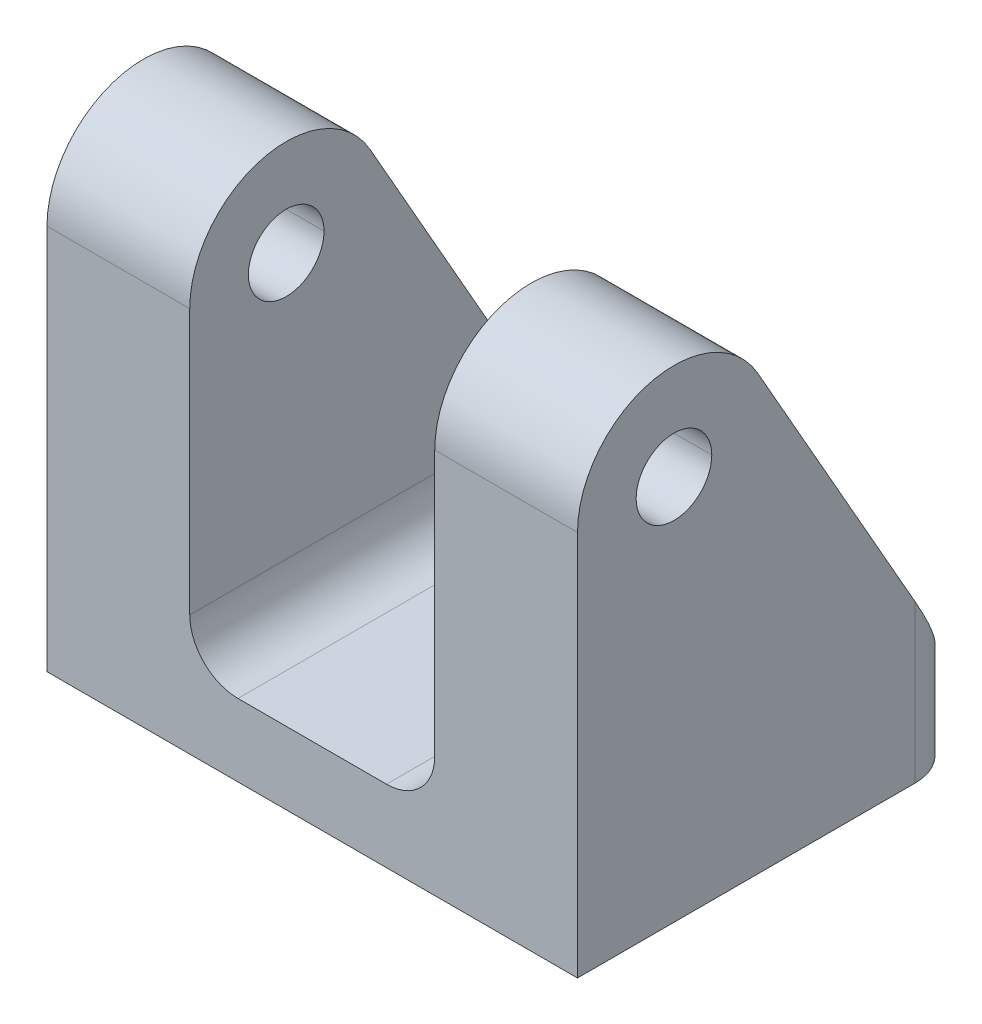
ISO-10303-21;
HEADER;
FILE_DESCRIPTION(('STEP AP214'),'2;1');
FILE_NAME('part.step','',(''),(''),'','','');
FILE_SCHEMA(('AUTOMOTIVE_DESIGN { 1 0 10303 214 1 1 1 1 }'));
ENDSEC;
DATA;
#1=APPLICATION_CONTEXT('core data for automotive mechanical design processes');
#2=APPLICATION_PROTOCOL_DEFINITION('international standard','automotive_design',2000,#1);
#3=PRODUCT_CONTEXT('',#1,'mechanical');
#4=PRODUCT('Part','Part','',(#3));
#5=PRODUCT_RELATED_PRODUCT_CATEGORY('part','',(#4));
#6=PRODUCT_DEFINITION_FORMATION('','',#4);
#7=PRODUCT_DEFINITION_CONTEXT('part definition',#1,'design');
#8=PRODUCT_DEFINITION('design','',#6,#7);
#9=PRODUCT_DEFINITION_SHAPE('','',#8);
#10=(LENGTH_UNIT() NAMED_UNIT(*) SI_UNIT(.MILLI.,.METRE.));
#11=(NAMED_UNIT(*) PLANE_ANGLE_UNIT() SI_UNIT($,.RADIAN.));
#12=(NAMED_UNIT(*) SI_UNIT($,.STERADIAN.) SOLID_ANGLE_UNIT());
#13=UNCERTAINTY_MEASURE_WITH_UNIT(LENGTH_MEASURE(1.E-05),#10,'distance_accuracy_value','');
#14=(GEOMETRIC_REPRESENTATION_CONTEXT(3) GLOBAL_UNCERTAINTY_ASSIGNED_CONTEXT((#13)) GLOBAL_UNIT_ASSIGNED_CONTEXT((#10,
#11,#12)) REPRESENTATION_CONTEXT('',''));
#15=CARTESIAN_POINT('',(0.,0.,0.));
#16=DIRECTION('',(0.,0.,1.));
#17=DIRECTION('',(1.,0.,0.));
#18=AXIS2_PLACEMENT_3D('',#15,#16,#17);
#19=CARTESIAN_POINT('',(4.8895,7.9375,-12.7));
#20=DIRECTION('',(0.,0.,-1.));
#21=DIRECTION('',(-1.,0.,0.));
#22=AXIS2_PLACEMENT_3D('',#19,#20,#21);
#23=CYLINDRICAL_SURFACE('',#22,3.175);
#24=CARTESIAN_POINT('',(4.8895,4.7625,-12.7));
#25=CARTESIAN_POINT('',(6.74937193946543,4.7625,-12.7));
#26=CARTESIAN_POINT('',(8.06450000000001,6.07762806053458,-11.9516212349029));
#27=CARTESIAN_POINT('',(8.0645,7.9375,-10.8932538355104));
#28=(BOUNDED_CURVE() B_SPLINE_CURVE(3,(#24,#25,#26,#27),.UNSPECIFIED.,.F.,
.F.) B_SPLINE_CURVE_WITH_KNOTS((4,4),(0.,1.5707963267949),
.UNSPECIFIED.) CURVE() GEOMETRIC_REPRESENTATION_ITEM() RATIONAL_B_SPLINE_CURVE((1.,
0.804737854124365,0.804737854124365,1.)) REPRESENTATION_ITEM(''));
#29=CARTESIAN_POINT('',(4.8895,4.7625,-12.7));
#30=VERTEX_POINT('',#29);
#31=CARTESIAN_POINT('',(8.0645,7.9375,-10.8932538355104));
#32=VERTEX_POINT('',#31);
#33=EDGE_CURVE('E357',#30,#32,#28,.T.);
#34=ORIENTED_EDGE('',*,*,#33,.F.);
#35=DIRECTION('',(0.,0.,-1.));
#36=VECTOR('',#35,1.);
#37=CARTESIAN_POINT('',(4.8895,4.7625,-12.7));
#38=LINE('',#37,#36);
#39=CARTESIAN_POINT('',(4.8895,4.7625,12.7));
#40=VERTEX_POINT('',#39);
#41=EDGE_CURVE('E297',#40,#30,#38,.T.);
#42=ORIENTED_EDGE('',*,*,#41,.F.);
#43=CARTESIAN_POINT('',(4.8895,7.9375,12.7));
#44=DIRECTION('',(0.,0.,-1.));
#45=DIRECTION('',(0.,-1.,0.));
#46=AXIS2_PLACEMENT_3D('',#43,#44,#45);
#47=CIRCLE('',#46,3.175);
#48=CARTESIAN_POINT('',(8.0645,7.9375,12.7));
#49=VERTEX_POINT('',#48);
#50=EDGE_CURVE('E324',#49,#40,#47,.T.);
#51=ORIENTED_EDGE('',*,*,#50,.F.);
#52=DIRECTION('',(0.,0.,1.));
#53=VECTOR('',#52,1.);
#54=CARTESIAN_POINT('',(8.0645,7.9375,12.7));
#55=LINE('',#54,#53);
#56=EDGE_CURVE('E296',#32,#49,#55,.T.);
#57=ORIENTED_EDGE('',*,*,#56,.F.);
#58=EDGE_LOOP('',(#34,#42,#51,#57));
#59=FACE_BOUND('',#58,.T.);
#60=ADVANCED_FACE('F17',(#59),#23,.F.);
#61=CARTESIAN_POINT('',(-4.8895,7.9375,-12.7));
#62=DIRECTION('',(0.,0.,-1.));
#63=DIRECTION('',(-1.,0.,0.));
#64=AXIS2_PLACEMENT_3D('',#61,#62,#63);
#65=CYLINDRICAL_SURFACE('',#64,3.175);
#66=CARTESIAN_POINT('',(-8.0645,7.9375,-10.8932538355104));
#67=CARTESIAN_POINT('',(-8.0645,6.07762806053458,-11.9516212349029));
#68=CARTESIAN_POINT('',(-6.74937193946543,4.7625,-12.7));
#69=CARTESIAN_POINT('',(-4.8895,4.7625,-12.7));
#70=(BOUNDED_CURVE() B_SPLINE_CURVE(3,(#66,#67,#68,#69),.UNSPECIFIED.,.F.,
.F.) B_SPLINE_CURVE_WITH_KNOTS((4,4),(4.71238898038469,6.28318530717959),
.UNSPECIFIED.) CURVE() GEOMETRIC_REPRESENTATION_ITEM() RATIONAL_B_SPLINE_CURVE((1.,
0.804737854124365,0.804737854124365,1.)) REPRESENTATION_ITEM(''));
#71=CARTESIAN_POINT('',(-8.0645,7.9375,-10.8932538355104));
#72=VERTEX_POINT('',#71);
#73=CARTESIAN_POINT('',(-4.8895,4.7625,-12.7));
#74=VERTEX_POINT('',#73);
#75=EDGE_CURVE('E274',#72,#74,#70,.T.);
#76=ORIENTED_EDGE('',*,*,#75,.F.);
#77=DIRECTION('',(0.,0.,-1.));
#78=VECTOR('',#77,1.);
#79=CARTESIAN_POINT('',(-8.0645,7.9375,-12.7));
#80=LINE('',#79,#78);
#81=CARTESIAN_POINT('',(-8.0645,7.9375,12.7));
#82=VERTEX_POINT('',#81);
#83=EDGE_CURVE('E293',#82,#72,#80,.T.);
#84=ORIENTED_EDGE('',*,*,#83,.F.);
#85=CARTESIAN_POINT('',(-4.8895,7.9375,12.7));
#86=DIRECTION('',(0.,0.,-1.));
#87=DIRECTION('',(0.,-1.,0.));
#88=AXIS2_PLACEMENT_3D('',#85,#86,#87);
#89=CIRCLE('',#88,3.175);
#90=CARTESIAN_POINT('',(-4.8895,4.7625,12.7));
#91=VERTEX_POINT('',#90);
#92=EDGE_CURVE('E286',#91,#82,#89,.T.);
#93=ORIENTED_EDGE('',*,*,#92,.F.);
#94=DIRECTION('',(0.,0.,1.));
#95=VECTOR('',#94,1.);
#96=CARTESIAN_POINT('',(-4.8895,4.7625,12.7));
#97=LINE('',#96,#95);
#98=EDGE_CURVE('E21',#74,#91,#97,.T.);
#99=ORIENTED_EDGE('',*,*,#98,.F.);
#100=EDGE_LOOP('',(#76,#84,#93,#99));
#101=FACE_BOUND('',#100,.T.);
#102=ADVANCED_FACE('F507',(#101),#65,.F.);
#103=CARTESIAN_POINT('',(12.7,0.,0.));
#104=DIRECTION('',(0.,-1.,0.));
#105=DIRECTION('',(0.,0.,-1.));
#106=AXIS2_PLACEMENT_3D('',#103,#104,#105);
#107=CYLINDRICAL_SURFACE('',#106,2.0193);
#108=DIRECTION('',(0.,-1.,0.));
#109=VECTOR('',#108,1.);
#110=CARTESIAN_POINT('',(12.7,0.,2.0193));
#111=LINE('',#110,#109);
#112=CARTESIAN_POINT('',(12.7,19.05,2.0193));
#113=VERTEX_POINT('',#112);
#114=CARTESIAN_POINT('',(12.7,0.,2.0193));
#115=VERTEX_POINT('',#114);
#116=EDGE_CURVE('E369',#113,#115,#111,.T.);
#117=ORIENTED_EDGE('',*,*,#116,.F.);
#118=CARTESIAN_POINT('',(12.7,19.05,0.));
#119=DIRECTION('',(0.,-1.,0.));
#120=DIRECTION('',(0.,0.,-1.));
#121=AXIS2_PLACEMENT_3D('',#118,#119,#120);
#122=CIRCLE('',#121,2.0193);
#123=CARTESIAN_POINT('',(12.7,19.05,-2.0193));
#124=VERTEX_POINT('',#123);
#125=EDGE_CURVE('E11',#124,#113,#122,.T.);
#126=ORIENTED_EDGE('',*,*,#125,.F.);
#127=DIRECTION('',(0.,-1.,0.));
#128=VECTOR('',#127,1.);
#129=CARTESIAN_POINT('',(12.7,0.,-2.0193));
#130=LINE('',#129,#128);
#131=CARTESIAN_POINT('',(12.7,0.,-2.0193));
#132=VERTEX_POINT('',#131);
#133=EDGE_CURVE('E449',#124,#132,#130,.T.);
#134=ORIENTED_EDGE('',*,*,#133,.T.);
#135=CARTESIAN_POINT('',(12.7,0.,0.));
#136=DIRECTION('',(0.,-1.,0.));
#137=DIRECTION('',(0.,0.,-1.));
#138=AXIS2_PLACEMENT_3D('',#135,#136,#137);
#139=CIRCLE('',#138,2.0193);
#140=EDGE_CURVE('E326',#132,#115,#139,.T.);
#141=ORIENTED_EDGE('',*,*,#140,.T.);
#142=EDGE_LOOP('',(#117,#126,#134,#141));
#143=FACE_BOUND('',#142,.T.);
#144=ADVANCED_FACE('F631',(#143),#107,.F.);
#145=CARTESIAN_POINT('',(12.7,19.05,0.));
#146=DIRECTION('',(0.,-1.,0.));
#147=DIRECTION('',(0.,0.,-1.));
#148=AXIS2_PLACEMENT_3D('',#145,#146,#147);
#149=CONICAL_SURFACE('',#148,2.0193,1.02974425867665);
#150=DIRECTION('',(0.,-0.515038074910057,0.857167300702111));
#151=VECTOR('',#150,1.);
#152=CARTESIAN_POINT('',(12.7,19.05,2.0193));
#153=LINE('',#152,#151);
#154=CARTESIAN_POINT('',(12.7,20.2633178480023,0.));
#155=VERTEX_POINT('',#154);
#156=EDGE_CURVE('E345',#155,#113,#153,.T.);
#157=ORIENTED_EDGE('',*,*,#156,.F.);
#158=DIRECTION('',(0.,-0.515038074910057,-0.857167300702111));
#159=VECTOR('',#158,1.);
#160=CARTESIAN_POINT('',(12.7,19.05,-2.0193));
#161=LINE('',#160,#159);
#162=EDGE_CURVE('E398',#155,#124,#161,.T.);
#163=ORIENTED_EDGE('',*,*,#162,.T.);
#164=ORIENTED_EDGE('',*,*,#125,.T.);
#165=EDGE_LOOP('',(#157,#163,#164));
#166=FACE_BOUND('',#165,.T.);
#167=ADVANCED_FACE('F19',(#166),#149,.F.);
#168=CARTESIAN_POINT('',(-12.7,0.,0.));
#169=DIRECTION('',(0.,-1.,0.));
#170=DIRECTION('',(0.,0.,-1.));
#171=AXIS2_PLACEMENT_3D('',#168,#169,#170);
#172=CYLINDRICAL_SURFACE('',#171,2.0193);
#173=DIRECTION('',(0.,-1.,0.));
#174=VECTOR('',#173,1.);
#175=CARTESIAN_POINT('',(-12.7,0.,2.0193));
#176=LINE('',#175,#174);
#177=CARTESIAN_POINT('',(-12.7,19.05,2.0193));
#178=VERTEX_POINT('',#177);
#179=CARTESIAN_POINT('',(-12.7,0.,2.0193));
#180=VERTEX_POINT('',#179);
#181=EDGE_CURVE('E344',#178,#180,#176,.T.);
#182=ORIENTED_EDGE('',*,*,#181,.F.);
#183=CARTESIAN_POINT('',(-12.7,19.05,0.));
#184=DIRECTION('',(0.,-1.,0.));
#185=DIRECTION('',(0.,0.,-1.));
#186=AXIS2_PLACEMENT_3D('',#183,#184,#185);
#187=CIRCLE('',#186,2.0193);
#188=CARTESIAN_POINT('',(-12.7,19.05,-2.0193));
#189=VERTEX_POINT('',#188);
#190=EDGE_CURVE('E28',#189,#178,#187,.T.);
#191=ORIENTED_EDGE('',*,*,#190,.F.);
#192=DIRECTION('',(0.,-1.,0.));
#193=VECTOR('',#192,1.);
#194=CARTESIAN_POINT('',(-12.7,0.,-2.0193));
#195=LINE('',#194,#193);
#196=CARTESIAN_POINT('',(-12.7,0.,-2.0193));
#197=VERTEX_POINT('',#196);
#198=EDGE_CURVE('E243',#189,#197,#195,.T.);
#199=ORIENTED_EDGE('',*,*,#198,.T.);
#200=CARTESIAN_POINT('',(-12.7,0.,0.));
#201=DIRECTION('',(0.,-1.,0.));
#202=DIRECTION('',(0.,0.,-1.));
#203=AXIS2_PLACEMENT_3D('',#200,#201,#202);
#204=CIRCLE('',#203,2.0193);
#205=EDGE_CURVE('E329',#197,#180,#204,.T.);
#206=ORIENTED_EDGE('',*,*,#205,.T.);
#207=EDGE_LOOP('',(#182,#191,#199,#206));
#208=FACE_BOUND('',#207,.T.);
#209=ADVANCED_FACE('F644',(#208),#172,.F.);
#210=CARTESIAN_POINT('',(-12.7,19.05,0.));
#211=DIRECTION('',(0.,-1.,0.));
#212=DIRECTION('',(0.,0.,-1.));
#213=AXIS2_PLACEMENT_3D('',#210,#211,#212);
#214=CONICAL_SURFACE('',#213,2.0193,1.02974425867665);
#215=DIRECTION('',(0.,-0.515038074910057,0.857167300702111));
#216=VECTOR('',#215,1.);
#217=CARTESIAN_POINT('',(-12.7,19.05,2.0193));
#218=LINE('',#217,#216);
#219=CARTESIAN_POINT('',(-12.7,20.2633178480023,0.));
#220=VERTEX_POINT('',#219);
#221=EDGE_CURVE('E228',#220,#178,#218,.T.);
#222=ORIENTED_EDGE('',*,*,#221,.F.);
#223=DIRECTION('',(0.,-0.515038074910057,-0.857167300702111));
#224=VECTOR('',#223,1.);
#225=CARTESIAN_POINT('',(-12.7,19.05,-2.0193));
#226=LINE('',#225,#224);
#227=EDGE_CURVE('E231',#220,#189,#226,.T.);
#228=ORIENTED_EDGE('',*,*,#227,.T.);
#229=ORIENTED_EDGE('',*,*,#190,.T.);
#230=EDGE_LOOP('',(#222,#228,#229));
#231=FACE_BOUND('',#230,.T.);
#232=ADVANCED_FACE('F230',(#231),#214,.F.);
#233=CARTESIAN_POINT('',(0.,0.,0.));
#234=DIRECTION('',(0.,-1.,0.));
#235=DIRECTION('',(0.,0.,-1.));
#236=AXIS2_PLACEMENT_3D('',#233,#234,#235);
#237=CYLINDRICAL_SURFACE('',#236,2.0193);
#238=DIRECTION('',(0.,-1.,0.));
#239=VECTOR('',#238,1.);
#240=CARTESIAN_POINT('',(0.,0.,2.0193));
#241=LINE('',#240,#239);
#242=CARTESIAN_POINT('',(0.,4.7625,2.0193));
#243=VERTEX_POINT('',#242);
#244=CARTESIAN_POINT('',(0.,0.,2.0193));
#245=VERTEX_POINT('',#244);
#246=EDGE_CURVE('E394',#243,#245,#241,.T.);
#247=ORIENTED_EDGE('',*,*,#246,.F.);
#248=CARTESIAN_POINT('',(0.,4.7625,0.));
#249=DIRECTION('',(0.,-1.,0.));
#250=DIRECTION('',(1.,0.,0.));
#251=AXIS2_PLACEMENT_3D('',#248,#249,#250);
#252=CIRCLE('',#251,2.0193);
#253=CARTESIAN_POINT('',(0.,4.7625,-2.0193));
#254=VERTEX_POINT('',#253);
#255=EDGE_CURVE('E300',#254,#243,#252,.T.);
#256=ORIENTED_EDGE('',*,*,#255,.F.);
#257=DIRECTION('',(0.,-1.,0.));
#258=VECTOR('',#257,1.);
#259=CARTESIAN_POINT('',(0.,0.,-2.0193));
#260=LINE('',#259,#258);
#261=CARTESIAN_POINT('',(0.,0.,-2.0193));
#262=VERTEX_POINT('',#261);
#263=EDGE_CURVE('E292',#254,#262,#260,.T.);
#264=ORIENTED_EDGE('',*,*,#263,.T.);
#265=CARTESIAN_POINT('',(0.,0.,0.));
#266=DIRECTION('',(0.,-1.,0.));
#267=DIRECTION('',(0.,0.,-1.));
#268=AXIS2_PLACEMENT_3D('',#265,#266,#267);
#269=CIRCLE('',#268,2.0193);
#270=EDGE_CURVE('E333',#262,#245,#269,.T.);
#271=ORIENTED_EDGE('',*,*,#270,.T.);
#272=EDGE_LOOP('',(#247,#256,#264,#271));
#273=FACE_BOUND('',#272,.T.);
#274=ADVANCED_FACE('F464',(#273),#237,.F.);
#275=CARTESIAN_POINT('',(-14.2875,0.,-9.525));
#276=DIRECTION('',(0.,1.,0.));
#277=DIRECTION('',(0.,0.,1.));
#278=AXIS2_PLACEMENT_3D('',#275,#276,#277);
#279=CYLINDRICAL_SURFACE('',#278,3.175);
#280=CARTESIAN_POINT('',(-14.2875,4.7625,-12.7));
#281=CARTESIAN_POINT('',(-16.1473719394654,4.76250000000002,-12.7));
#282=CARTESIAN_POINT('',(-17.4625,7.07357815489786,-11.3848719394654));
#283=CARTESIAN_POINT('',(-17.4625,10.3419362252586,-9.525));
#284=(BOUNDED_CURVE() B_SPLINE_CURVE(3,(#280,#281,#282,#283),.UNSPECIFIED.,.F.,
.F.) B_SPLINE_CURVE_WITH_KNOTS((4,4),(3.1415926535898,4.71238898038469),
.UNSPECIFIED.) CURVE() GEOMETRIC_REPRESENTATION_ITEM() RATIONAL_B_SPLINE_CURVE((1.,
0.804737854124365,0.804737854124365,1.)) REPRESENTATION_ITEM(''));
#285=CARTESIAN_POINT('',(-14.2875,4.7625,-12.7));
#286=VERTEX_POINT('',#285);
#287=CARTESIAN_POINT('',(-17.4625,10.3419362252586,-9.525));
#288=VERTEX_POINT('',#287);
#289=EDGE_CURVE('E255',#286,#288,#284,.T.);
#290=ORIENTED_EDGE('',*,*,#289,.F.);
#291=DIRECTION('',(0.,1.,0.));
#292=VECTOR('',#291,1.);
#293=CARTESIAN_POINT('',(-14.2875,4.7625,-12.7));
#294=LINE('',#293,#292);
#295=CARTESIAN_POINT('',(-14.2875,0.,-12.7));
#296=VERTEX_POINT('',#295);
#297=EDGE_CURVE('E305',#296,#286,#294,.T.);
#298=ORIENTED_EDGE('',*,*,#297,.F.);
#299=CARTESIAN_POINT('',(-14.2875,0.,-9.525));
#300=DIRECTION('',(0.,-1.,0.));
#301=DIRECTION('',(0.,0.,-1.));
#302=AXIS2_PLACEMENT_3D('',#299,#300,#301);
#303=CIRCLE('',#302,3.175);
#304=CARTESIAN_POINT('',(-17.4625,0.,-9.525));
#305=VERTEX_POINT('',#304);
#306=EDGE_CURVE('E330',#305,#296,#303,.T.);
#307=ORIENTED_EDGE('',*,*,#306,.F.);
#308=DIRECTION('',(0.,-1.,0.));
#309=VECTOR('',#308,1.);
#310=CARTESIAN_POINT('',(-17.4625,0.,-9.525));
#311=LINE('',#310,#309);
#312=EDGE_CURVE('E42',#288,#305,#311,.T.);
#313=ORIENTED_EDGE('',*,*,#312,.F.);
#314=EDGE_LOOP('',(#290,#298,#307,#313));
#315=FACE_BOUND('',#314,.T.);
#316=ADVANCED_FACE('F494',(#315),#279,.T.);
#317=CARTESIAN_POINT('',(14.2875,0.,-9.525));
#318=DIRECTION('',(0.,-1.,0.));
#319=DIRECTION('',(0.,0.,-1.));
#320=AXIS2_PLACEMENT_3D('',#317,#318,#319);
#321=CYLINDRICAL_SURFACE('',#320,3.175);
#322=CARTESIAN_POINT('',(17.4625,10.3419362252586,-9.525));
#323=CARTESIAN_POINT('',(17.4625,7.07357815489786,-11.3848719394654));
#324=CARTESIAN_POINT('',(16.1473719394654,4.76250000000001,-12.7));
#325=CARTESIAN_POINT('',(14.2875,4.7625,-12.7));
#326=(BOUNDED_CURVE() B_SPLINE_CURVE(3,(#322,#323,#324,#325),.UNSPECIFIED.,.F.,
.F.) B_SPLINE_CURVE_WITH_KNOTS((4,4),(4.71238898038469,6.28318530717959),
.UNSPECIFIED.) CURVE() GEOMETRIC_REPRESENTATION_ITEM() RATIONAL_B_SPLINE_CURVE((1.,
0.804737854124365,0.804737854124365,1.)) REPRESENTATION_ITEM(''));
#327=CARTESIAN_POINT('',(17.4625,10.3419362252586,-9.525));
#328=VERTEX_POINT('',#327);
#329=CARTESIAN_POINT('',(14.2875,4.7625,-12.7));
#330=VERTEX_POINT('',#329);
#331=EDGE_CURVE('E337',#328,#330,#326,.T.);
#332=ORIENTED_EDGE('',*,*,#331,.F.);
#333=DIRECTION('',(0.,1.,0.));
#334=VECTOR('',#333,1.);
#335=CARTESIAN_POINT('',(17.4625,0.,-9.525));
#336=LINE('',#335,#334);
#337=CARTESIAN_POINT('',(17.4625,0.,-9.525));
#338=VERTEX_POINT('',#337);
#339=EDGE_CURVE('E408',#338,#328,#336,.T.);
#340=ORIENTED_EDGE('',*,*,#339,.F.);
#341=CARTESIAN_POINT('',(14.2875,0.,-9.525));
#342=DIRECTION('',(0.,-1.,0.));
#343=DIRECTION('',(0.,0.,-1.));
#344=AXIS2_PLACEMENT_3D('',#341,#342,#343);
#345=CIRCLE('',#344,3.175);
#346=CARTESIAN_POINT('',(14.2875,0.,-12.7));
#347=VERTEX_POINT('',#346);
#348=EDGE_CURVE('E285',#347,#338,#345,.T.);
#349=ORIENTED_EDGE('',*,*,#348,.F.);
#350=DIRECTION('',(0.,-1.,0.));
#351=VECTOR('',#350,1.);
#352=CARTESIAN_POINT('',(14.2875,0.,-12.7));
#353=LINE('',#352,#351);
#354=EDGE_CURVE('E309',#330,#347,#353,.T.);
#355=ORIENTED_EDGE('',*,*,#354,.F.);
#356=EDGE_LOOP('',(#332,#340,#349,#355));
#357=FACE_BOUND('',#356,.T.);
#358=ADVANCED_FACE('F470',(#357),#321,.T.);
#359=CARTESIAN_POINT('',(-8.0645,4.7625,-12.7));
#360=DIRECTION('',(0.,-1.,0.));
#361=DIRECTION('',(0.,0.,-1.));
#362=AXIS2_PLACEMENT_3D('',#359,#360,#361);
#363=PLANE('',#362);
#364=ORIENTED_EDGE('',*,*,#255,.T.);
#365=CARTESIAN_POINT('',(0.,4.7625,0.));
#366=DIRECTION('',(0.,-1.,0.));
#367=DIRECTION('',(1.,0.,0.));
#368=AXIS2_PLACEMENT_3D('',#365,#366,#367);
#369=CIRCLE('',#368,2.0193);
#370=EDGE_CURVE('E237',#243,#254,#369,.T.);
#371=ORIENTED_EDGE('',*,*,#370,.T.);
#372=EDGE_LOOP('',(#364,#371));
#373=FACE_BOUND('',#372,.T.);
#374=DIRECTION('',(1.,0.,0.));
#375=VECTOR('',#374,1.);
#376=CARTESIAN_POINT('',(-8.0645,4.7625,-12.7));
#377=LINE('',#376,#375);
#378=EDGE_CURVE('E308',#74,#30,#377,.T.);
#379=ORIENTED_EDGE('',*,*,#378,.F.);
#380=ORIENTED_EDGE('',*,*,#98,.T.);
#381=DIRECTION('',(1.,0.,0.));
#382=VECTOR('',#381,1.);
#383=CARTESIAN_POINT('',(-8.0645,4.7625,12.7));
#384=LINE('',#383,#382);
#385=EDGE_CURVE('E361',#91,#40,#384,.T.);
#386=ORIENTED_EDGE('',*,*,#385,.T.);
#387=ORIENTED_EDGE('',*,*,#41,.T.);
#388=EDGE_LOOP('',(#379,#380,#386,#387));
#389=FACE_BOUND('',#388,.T.);
#390=ADVANCED_FACE('F466',(#373,#389),#363,.F.);
#391=CARTESIAN_POINT('',(8.0645,4.7625,-12.7));
#392=DIRECTION('',(1.,0.,0.));
#393=DIRECTION('',(0.,1.,0.));
#394=AXIS2_PLACEMENT_3D('',#391,#392,#393);
#395=PLANE('',#394);
#396=CARTESIAN_POINT('',(8.0645,25.4,6.35));
#397=DIRECTION('',(1.,0.,0.));
#398=DIRECTION('',(0.,1.,0.));
#399=AXIS2_PLACEMENT_3D('',#396,#397,#398);
#400=CIRCLE('',#399,2.4892);
#401=CARTESIAN_POINT('',(8.0645,25.4,8.8392));
#402=VERTEX_POINT('',#401);
#403=CARTESIAN_POINT('',(8.0645,25.4,3.8608));
#404=VERTEX_POINT('',#403);
#405=EDGE_CURVE('E304',#402,#404,#400,.T.);
#406=ORIENTED_EDGE('',*,*,#405,.T.);
#407=CARTESIAN_POINT('',(8.0645,25.4,6.35));
#408=DIRECTION('',(1.,0.,0.));
#409=DIRECTION('',(0.,1.,0.));
#410=AXIS2_PLACEMENT_3D('',#407,#408,#409);
#411=CIRCLE('',#410,2.4892);
#412=EDGE_CURVE('E411',#404,#402,#411,.T.);
#413=ORIENTED_EDGE('',*,*,#412,.T.);
#414=EDGE_LOOP('',(#406,#413));
#415=FACE_BOUND('',#414,.T.);
#416=DIRECTION('',(0.,0.869130808993556,0.494582285224821));
#417=VECTOR('',#416,1.);
#418=CARTESIAN_POINT('',(8.0645,6.62414303176311,-11.6406247536105));
#419=LINE('',#418,#417);
#420=CARTESIAN_POINT('',(8.0645,28.5405975111776,0.831019362890917));
#421=VERTEX_POINT('',#420);
#422=EDGE_CURVE('E352',#32,#421,#419,.T.);
#423=ORIENTED_EDGE('',*,*,#422,.F.);
#424=ORIENTED_EDGE('',*,*,#56,.T.);
#425=DIRECTION('',(0.,1.,0.));
#426=VECTOR('',#425,1.);
#427=CARTESIAN_POINT('',(8.0645,4.7625,12.7));
#428=LINE('',#427,#426);
#429=CARTESIAN_POINT('',(8.0645,25.4,12.7));
#430=VERTEX_POINT('',#429);
#431=EDGE_CURVE('E321',#49,#430,#428,.T.);
#432=ORIENTED_EDGE('',*,*,#431,.T.);
#433=CARTESIAN_POINT('',(8.0645,25.4,6.35));
#434=DIRECTION('',(1.,0.,0.));
#435=DIRECTION('',(0.,1.,0.));
#436=AXIS2_PLACEMENT_3D('',#433,#434,#435);
#437=CIRCLE('',#436,6.35);
#438=EDGE_CURVE('E280',#421,#430,#437,.T.);
#439=ORIENTED_EDGE('',*,*,#438,.F.);
#440=EDGE_LOOP('',(#423,#424,#432,#439));
#441=FACE_BOUND('',#440,.T.);
#442=ADVANCED_FACE('F469',(#415,#441),#395,.F.);
#443=CARTESIAN_POINT('',(-8.0645,4.7625,-12.7));
#444=DIRECTION('',(-1.,0.,0.));
#445=DIRECTION('',(0.,0.,1.));
#446=AXIS2_PLACEMENT_3D('',#443,#444,#445);
#447=PLANE('',#446);
#448=CARTESIAN_POINT('',(-8.0645,25.4,6.35));
#449=DIRECTION('',(-1.,0.,0.));
#450=DIRECTION('',(0.,0.,1.));
#451=AXIS2_PLACEMENT_3D('',#448,#449,#450);
#452=CIRCLE('',#451,2.4892);
#453=CARTESIAN_POINT('',(-8.0645,25.4,8.8392));
#454=VERTEX_POINT('',#453);
#455=CARTESIAN_POINT('',(-8.0645,25.4,3.8608));
#456=VERTEX_POINT('',#455);
#457=EDGE_CURVE('E320',#454,#456,#452,.T.);
#458=ORIENTED_EDGE('',*,*,#457,.T.);
#459=CARTESIAN_POINT('',(-8.0645,25.4,6.35));
#460=DIRECTION('',(-1.,0.,0.));
#461=DIRECTION('',(0.,0.,1.));
#462=AXIS2_PLACEMENT_3D('',#459,#460,#461);
#463=CIRCLE('',#462,2.4892);
#464=EDGE_CURVE('E315',#456,#454,#463,.T.);
#465=ORIENTED_EDGE('',*,*,#464,.T.);
#466=EDGE_LOOP('',(#458,#465));
#467=FACE_BOUND('',#466,.T.);
#468=DIRECTION('',(0.,-1.,0.));
#469=VECTOR('',#468,1.);
#470=CARTESIAN_POINT('',(-8.0645,4.7625,12.7));
#471=LINE('',#470,#469);
#472=CARTESIAN_POINT('',(-8.0645,25.4,12.7));
#473=VERTEX_POINT('',#472);
#474=EDGE_CURVE('E420',#473,#82,#471,.T.);
#475=ORIENTED_EDGE('',*,*,#474,.T.);
#476=ORIENTED_EDGE('',*,*,#83,.T.);
#477=DIRECTION('',(0.,-0.869130808993556,-0.494582285224821));
#478=VECTOR('',#477,1.);
#479=CARTESIAN_POINT('',(-8.0645,6.62414303176311,-11.6406247536105));
#480=LINE('',#479,#478);
#481=CARTESIAN_POINT('',(-8.0645,28.5405975111776,0.831019362890917));
#482=VERTEX_POINT('',#481);
#483=EDGE_CURVE('E341',#482,#72,#480,.T.);
#484=ORIENTED_EDGE('',*,*,#483,.F.);
#485=CARTESIAN_POINT('',(-8.0645,25.4,6.35));
#486=DIRECTION('',(-1.,0.,0.));
#487=DIRECTION('',(0.,0.,1.));
#488=AXIS2_PLACEMENT_3D('',#485,#486,#487);
#489=CIRCLE('',#488,6.35);
#490=EDGE_CURVE('E273',#473,#482,#489,.T.);
#491=ORIENTED_EDGE('',*,*,#490,.F.);
#492=EDGE_LOOP('',(#475,#476,#484,#491));
#493=FACE_BOUND('',#492,.T.);
#494=ADVANCED_FACE('F505',(#467,#493),#447,.F.);
#495=CARTESIAN_POINT('',(-17.4625,0.,0.));
#496=DIRECTION('',(1.,0.,0.));
#497=DIRECTION('',(0.,1.,0.));
#498=AXIS2_PLACEMENT_3D('',#495,#496,#497);
#499=PLANE('',#498);
#500=CARTESIAN_POINT('',(-17.4625,25.4,6.35));
#501=DIRECTION('',(1.,0.,0.));
#502=DIRECTION('',(0.,0.,-1.));
#503=AXIS2_PLACEMENT_3D('',#500,#501,#502);
#504=CIRCLE('',#503,2.4892);
#505=CARTESIAN_POINT('',(-17.4625,25.4,8.8392));
#506=VERTEX_POINT('',#505);
#507=CARTESIAN_POINT('',(-17.4625,25.4,3.8608));
#508=VERTEX_POINT('',#507);
#509=EDGE_CURVE('E314',#506,#508,#504,.T.);
#510=ORIENTED_EDGE('',*,*,#509,.T.);
#511=CARTESIAN_POINT('',(-17.4625,25.4,6.35));
#512=DIRECTION('',(1.,0.,0.));
#513=DIRECTION('',(0.,0.,-1.));
#514=AXIS2_PLACEMENT_3D('',#511,#512,#513);
#515=CIRCLE('',#514,2.4892);
#516=EDGE_CURVE('E316',#508,#506,#515,.T.);
#517=ORIENTED_EDGE('',*,*,#516,.T.);
#518=EDGE_LOOP('',(#510,#517));
#519=FACE_BOUND('',#518,.T.);
#520=DIRECTION('',(0.,0.869130808993556,0.494582285224821));
#521=VECTOR('',#520,1.);
#522=CARTESIAN_POINT('',(-17.4625,6.62414303176311,-11.6406247536105));
#523=LINE('',#522,#521);
#524=CARTESIAN_POINT('',(-17.4625,28.5405975111776,0.831019362890918));
#525=VERTEX_POINT('',#524);
#526=EDGE_CURVE('E260',#288,#525,#523,.T.);
#527=ORIENTED_EDGE('',*,*,#526,.F.);
#528=ORIENTED_EDGE('',*,*,#312,.T.);
#529=DIRECTION('',(0.,0.,1.));
#530=VECTOR('',#529,1.);
#531=CARTESIAN_POINT('',(-17.4625,0.,0.));
#532=LINE('',#531,#530);
#533=CARTESIAN_POINT('',(-17.4625,0.,12.7));
#534=VERTEX_POINT('',#533);
#535=EDGE_CURVE('E402',#305,#534,#532,.T.);
#536=ORIENTED_EDGE('',*,*,#535,.T.);
#537=DIRECTION('',(0.,1.,0.));
#538=VECTOR('',#537,1.);
#539=CARTESIAN_POINT('',(-17.4625,0.,12.7));
#540=LINE('',#539,#538);
#541=CARTESIAN_POINT('',(-17.4625,25.4,12.7));
#542=VERTEX_POINT('',#541);
#543=EDGE_CURVE('E423',#534,#542,#540,.T.);
#544=ORIENTED_EDGE('',*,*,#543,.T.);
#545=CARTESIAN_POINT('',(-17.4625,25.4,6.35));
#546=DIRECTION('',(1.,0.,0.));
#547=DIRECTION('',(0.,0.,-1.));
#548=AXIS2_PLACEMENT_3D('',#545,#546,#547);
#549=CIRCLE('',#548,6.35);
#550=EDGE_CURVE('E427',#525,#542,#549,.T.);
#551=ORIENTED_EDGE('',*,*,#550,.F.);
#552=EDGE_LOOP('',(#527,#528,#536,#544,#551));
#553=FACE_BOUND('',#552,.T.);
#554=ADVANCED_FACE('F495',(#519,#553),#499,.F.);
#555=CARTESIAN_POINT('',(17.4625,0.,0.));
#556=DIRECTION('',(1.,0.,0.));
#557=DIRECTION('',(0.,1.,0.));
#558=AXIS2_PLACEMENT_3D('',#555,#556,#557);
#559=PLANE('',#558);
#560=CARTESIAN_POINT('',(17.4625,25.4,6.35));
#561=DIRECTION('',(1.,0.,0.));
#562=DIRECTION('',(0.,0.,-1.));
#563=AXIS2_PLACEMENT_3D('',#560,#561,#562);
#564=CIRCLE('',#563,2.4892);
#565=CARTESIAN_POINT('',(17.4625,25.4,8.8392));
#566=VERTEX_POINT('',#565);
#567=CARTESIAN_POINT('',(17.4625,25.4,3.8608));
#568=VERTEX_POINT('',#567);
#569=EDGE_CURVE('E287',#566,#568,#564,.T.);
#570=ORIENTED_EDGE('',*,*,#569,.F.);
#571=CARTESIAN_POINT('',(17.4625,25.4,6.35));
#572=DIRECTION('',(1.,0.,0.));
#573=DIRECTION('',(0.,0.,-1.));
#574=AXIS2_PLACEMENT_3D('',#571,#572,#573);
#575=CIRCLE('',#574,2.4892);
#576=EDGE_CURVE('E481',#568,#566,#575,.T.);
#577=ORIENTED_EDGE('',*,*,#576,.F.);
#578=EDGE_LOOP('',(#570,#577));
#579=FACE_BOUND('',#578,.T.);
#580=DIRECTION('',(0.,0.,1.));
#581=VECTOR('',#580,1.);
#582=CARTESIAN_POINT('',(17.4625,0.,0.));
#583=LINE('',#582,#581);
#584=CARTESIAN_POINT('',(17.4625,0.,12.7));
#585=VERTEX_POINT('',#584);
#586=EDGE_CURVE('E405',#338,#585,#583,.T.);
#587=ORIENTED_EDGE('',*,*,#586,.F.);
#588=ORIENTED_EDGE('',*,*,#339,.T.);
#589=DIRECTION('',(0.,0.869130808993556,0.494582285224821));
#590=VECTOR('',#589,1.);
#591=CARTESIAN_POINT('',(17.4625,6.62414303176311,-11.6406247536105));
#592=LINE('',#591,#590);
#593=CARTESIAN_POINT('',(17.4625,28.5405975111776,0.831019362890918));
#594=VERTEX_POINT('',#593);
#595=EDGE_CURVE('E319',#328,#594,#592,.T.);
#596=ORIENTED_EDGE('',*,*,#595,.T.);
#597=CARTESIAN_POINT('',(17.4625,25.4,6.35));
#598=DIRECTION('',(1.,0.,0.));
#599=DIRECTION('',(0.,0.,-1.));
#600=AXIS2_PLACEMENT_3D('',#597,#598,#599);
#601=CIRCLE('',#600,6.35);
#602=CARTESIAN_POINT('',(17.4625,25.4,12.7));
#603=VERTEX_POINT('',#602);
#604=EDGE_CURVE('E279',#594,#603,#601,.T.);
#605=ORIENTED_EDGE('',*,*,#604,.T.);
#606=DIRECTION('',(0.,1.,0.));
#607=VECTOR('',#606,1.);
#608=CARTESIAN_POINT('',(17.4625,0.,12.7));
#609=LINE('',#608,#607);
#610=EDGE_CURVE('E325',#585,#603,#609,.T.);
#611=ORIENTED_EDGE('',*,*,#610,.F.);
#612=EDGE_LOOP('',(#587,#588,#596,#605,#611));
#613=FACE_BOUND('',#612,.T.);
#614=ADVANCED_FACE('F592',(#579,#613),#559,.T.);
#615=CARTESIAN_POINT('',(17.4625,25.4,6.35));
#616=DIRECTION('',(-1.,0.,0.));
#617=DIRECTION('',(0.,0.,1.));
#618=AXIS2_PLACEMENT_3D('',#615,#616,#617);
#619=CYLINDRICAL_SURFACE('',#618,2.4892);
#620=DIRECTION('',(-1.,0.,0.));
#621=VECTOR('',#620,1.);
#622=CARTESIAN_POINT('',(17.4625,25.4,3.8608));
#623=LINE('',#622,#621);
#624=EDGE_CURVE('E291',#568,#404,#623,.T.);
#625=ORIENTED_EDGE('',*,*,#624,.F.);
#626=ORIENTED_EDGE('',*,*,#576,.T.);
#627=DIRECTION('',(-1.,0.,0.));
#628=VECTOR('',#627,1.);
#629=CARTESIAN_POINT('',(17.4625,25.4,8.8392));
#630=LINE('',#629,#628);
#631=EDGE_CURVE('E419',#566,#402,#630,.T.);
#632=ORIENTED_EDGE('',*,*,#631,.T.);
#633=ORIENTED_EDGE('',*,*,#412,.F.);
#634=EDGE_LOOP('',(#625,#626,#632,#633));
#635=FACE_BOUND('',#634,.T.);
#636=ADVANCED_FACE('F611',(#635),#619,.F.);
#637=CARTESIAN_POINT('',(17.4625,0.,-12.7));
#638=DIRECTION('',(0.,0.,-1.));
#639=DIRECTION('',(0.,-1.,0.));
#640=AXIS2_PLACEMENT_3D('',#637,#638,#639);
#641=PLANE('',#640);
#642=DIRECTION('',(-1.,0.,0.));
#643=VECTOR('',#642,1.);
#644=CARTESIAN_POINT('',(17.4625,4.7625,-12.7));
#645=LINE('',#644,#643);
#646=EDGE_CURVE('E525',#330,#30,#645,.T.);
#647=ORIENTED_EDGE('',*,*,#646,.F.);
#648=ORIENTED_EDGE('',*,*,#354,.T.);
#649=DIRECTION('',(-1.,0.,0.));
#650=VECTOR('',#649,1.);
#651=CARTESIAN_POINT('',(17.4625,0.,-12.7));
#652=LINE('',#651,#650);
#653=EDGE_CURVE('E281',#347,#296,#652,.T.);
#654=ORIENTED_EDGE('',*,*,#653,.T.);
#655=ORIENTED_EDGE('',*,*,#297,.T.);
#656=DIRECTION('',(-1.,0.,0.));
#657=VECTOR('',#656,1.);
#658=CARTESIAN_POINT('',(17.4625,4.7625,-12.7));
#659=LINE('',#658,#657);
#660=EDGE_CURVE('E261',#74,#286,#659,.T.);
#661=ORIENTED_EDGE('',*,*,#660,.F.);
#662=ORIENTED_EDGE('',*,*,#378,.T.);
#663=EDGE_LOOP('',(#647,#648,#654,#655,#661,#662));
#664=FACE_BOUND('',#663,.T.);
#665=ADVANCED_FACE('F489',(#664),#641,.T.);
#666=CARTESIAN_POINT('',(17.4625,0.,0.));
#667=DIRECTION('',(0.,-1.,0.));
#668=DIRECTION('',(0.,0.,-1.));
#669=AXIS2_PLACEMENT_3D('',#666,#667,#668);
#670=PLANE('',#669);
#671=ORIENTED_EDGE('',*,*,#270,.F.);
#672=CARTESIAN_POINT('',(0.,0.,0.));
#673=DIRECTION('',(0.,-1.,0.));
#674=DIRECTION('',(0.,0.,-1.));
#675=AXIS2_PLACEMENT_3D('',#672,#673,#674);
#676=CIRCLE('',#675,2.0193);
#677=EDGE_CURVE('E351',#245,#262,#676,.T.);
#678=ORIENTED_EDGE('',*,*,#677,.F.);
#679=EDGE_LOOP('',(#671,#678));
#680=FACE_BOUND('',#679,.T.);
#681=ORIENTED_EDGE('',*,*,#205,.F.);
#682=CARTESIAN_POINT('',(-12.7,0.,0.));
#683=DIRECTION('',(0.,-1.,0.));
#684=DIRECTION('',(0.,0.,-1.));
#685=AXIS2_PLACEMENT_3D('',#682,#683,#684);
#686=CIRCLE('',#685,2.0193);
#687=EDGE_CURVE('E251',#180,#197,#686,.T.);
#688=ORIENTED_EDGE('',*,*,#687,.F.);
#689=EDGE_LOOP('',(#681,#688));
#690=FACE_BOUND('',#689,.T.);
#691=ORIENTED_EDGE('',*,*,#140,.F.);
#692=CARTESIAN_POINT('',(12.7,0.,0.));
#693=DIRECTION('',(0.,-1.,0.));
#694=DIRECTION('',(0.,0.,-1.));
#695=AXIS2_PLACEMENT_3D('',#692,#693,#694);
#696=CIRCLE('',#695,2.0193);
#697=EDGE_CURVE('E453',#115,#132,#696,.T.);
#698=ORIENTED_EDGE('',*,*,#697,.F.);
#699=EDGE_LOOP('',(#691,#698));
#700=FACE_BOUND('',#699,.T.);
#701=ORIENTED_EDGE('',*,*,#653,.F.);
#702=ORIENTED_EDGE('',*,*,#348,.T.);
#703=ORIENTED_EDGE('',*,*,#586,.T.);
#704=DIRECTION('',(-1.,0.,0.));
#705=VECTOR('',#704,1.);
#706=CARTESIAN_POINT('',(17.4625,0.,12.7));
#707=LINE('',#706,#705);
#708=EDGE_CURVE('E401',#585,#534,#707,.T.);
#709=ORIENTED_EDGE('',*,*,#708,.T.);
#710=ORIENTED_EDGE('',*,*,#535,.F.);
#711=ORIENTED_EDGE('',*,*,#306,.T.);
#712=EDGE_LOOP('',(#701,#702,#703,#709,#710,#711));
#713=FACE_BOUND('',#712,.T.);
#714=ADVANCED_FACE('F597',(#680,#690,#700,#713),#670,.T.);
#715=CARTESIAN_POINT('',(17.4625,0.,12.7));
#716=DIRECTION('',(0.,0.,1.));
#717=DIRECTION('',(0.,-1.,0.));
#718=AXIS2_PLACEMENT_3D('',#715,#716,#717);
#719=PLANE('',#718);
#720=ORIENTED_EDGE('',*,*,#474,.F.);
#721=DIRECTION('',(-1.,0.,0.));
#722=VECTOR('',#721,1.);
#723=CARTESIAN_POINT('',(17.4625,25.4,12.7));
#724=LINE('',#723,#722);
#725=EDGE_CURVE('E269',#473,#542,#724,.T.);
#726=ORIENTED_EDGE('',*,*,#725,.T.);
#727=ORIENTED_EDGE('',*,*,#543,.F.);
#728=ORIENTED_EDGE('',*,*,#708,.F.);
#729=ORIENTED_EDGE('',*,*,#610,.T.);
#730=DIRECTION('',(-1.,0.,0.));
#731=VECTOR('',#730,1.);
#732=CARTESIAN_POINT('',(17.4625,25.4,12.7));
#733=LINE('',#732,#731);
#734=EDGE_CURVE('E275',#603,#430,#733,.T.);
#735=ORIENTED_EDGE('',*,*,#734,.T.);
#736=ORIENTED_EDGE('',*,*,#431,.F.);
#737=ORIENTED_EDGE('',*,*,#50,.T.);
#738=ORIENTED_EDGE('',*,*,#385,.F.);
#739=ORIENTED_EDGE('',*,*,#92,.T.);
#740=EDGE_LOOP('',(#720,#726,#727,#728,#729,#735,#736,#737,#738,#739));
#741=FACE_BOUND('',#740,.T.);
#742=ADVANCED_FACE('F510',(#741),#719,.T.);
#743=CARTESIAN_POINT('',(17.4625,25.4,6.35));
#744=DIRECTION('',(-1.,0.,0.));
#745=DIRECTION('',(0.,0.,1.));
#746=AXIS2_PLACEMENT_3D('',#743,#744,#745);
#747=CYLINDRICAL_SURFACE('',#746,6.35);
#748=ORIENTED_EDGE('',*,*,#438,.T.);
#749=ORIENTED_EDGE('',*,*,#734,.F.);
#750=ORIENTED_EDGE('',*,*,#604,.F.);
#751=DIRECTION('',(-1.,0.,0.));
#752=VECTOR('',#751,1.);
#753=CARTESIAN_POINT('',(17.4625,28.5405975111776,0.831019362890918));
#754=LINE('',#753,#752);
#755=EDGE_CURVE('E356',#594,#421,#754,.T.);
#756=ORIENTED_EDGE('',*,*,#755,.T.);
#757=EDGE_LOOP('',(#748,#749,#750,#756));
#758=FACE_BOUND('',#757,.T.);
#759=ADVANCED_FACE('F573',(#758),#747,.T.);
#760=CARTESIAN_POINT('',(17.4625,6.62414303176311,-11.6406247536105));
#761=DIRECTION('',(0.,-0.494582285224821,0.869130808993556));
#762=DIRECTION('',(-1.,0.,0.));
#763=AXIS2_PLACEMENT_3D('',#760,#761,#762);
#764=PLANE('',#763);
#765=ORIENTED_EDGE('',*,*,#595,.F.);
#766=ORIENTED_EDGE('',*,*,#331,.T.);
#767=ORIENTED_EDGE('',*,*,#646,.T.);
#768=ORIENTED_EDGE('',*,*,#33,.T.);
#769=ORIENTED_EDGE('',*,*,#422,.T.);
#770=ORIENTED_EDGE('',*,*,#755,.F.);
#771=EDGE_LOOP('',(#765,#766,#767,#768,#769,#770));
#772=FACE_BOUND('',#771,.T.);
#773=ADVANCED_FACE('F578',(#772),#764,.F.);
#774=CARTESIAN_POINT('',(17.4625,25.4,6.35));
#775=DIRECTION('',(-1.,0.,0.));
#776=DIRECTION('',(0.,0.,1.));
#777=AXIS2_PLACEMENT_3D('',#774,#775,#776);
#778=CYLINDRICAL_SURFACE('',#777,2.4892);
#779=DIRECTION('',(-1.,0.,0.));
#780=VECTOR('',#779,1.);
#781=CARTESIAN_POINT('',(17.4625,25.4,3.8608));
#782=LINE('',#781,#780);
#783=EDGE_CURVE('E310',#456,#508,#782,.T.);
#784=ORIENTED_EDGE('',*,*,#783,.F.);
#785=ORIENTED_EDGE('',*,*,#457,.F.);
#786=DIRECTION('',(-1.,0.,0.));
#787=VECTOR('',#786,1.);
#788=CARTESIAN_POINT('',(17.4625,25.4,8.8392));
#789=LINE('',#788,#787);
#790=EDGE_CURVE('E415',#454,#506,#789,.T.);
#791=ORIENTED_EDGE('',*,*,#790,.T.);
#792=ORIENTED_EDGE('',*,*,#516,.F.);
#793=EDGE_LOOP('',(#784,#785,#791,#792));
#794=FACE_BOUND('',#793,.T.);
#795=ADVANCED_FACE('F637',(#794),#778,.F.);
#796=CARTESIAN_POINT('',(17.4625,25.4,6.35));
#797=DIRECTION('',(-1.,0.,0.));
#798=DIRECTION('',(0.,0.,1.));
#799=AXIS2_PLACEMENT_3D('',#796,#797,#798);
#800=CYLINDRICAL_SURFACE('',#799,6.35);
#801=ORIENTED_EDGE('',*,*,#725,.F.);
#802=ORIENTED_EDGE('',*,*,#490,.T.);
#803=DIRECTION('',(-1.,0.,0.));
#804=VECTOR('',#803,1.);
#805=CARTESIAN_POINT('',(17.4625,28.5405975111776,0.831019362890918));
#806=LINE('',#805,#804);
#807=EDGE_CURVE('E268',#482,#525,#806,.T.);
#808=ORIENTED_EDGE('',*,*,#807,.T.);
#809=ORIENTED_EDGE('',*,*,#550,.T.);
#810=EDGE_LOOP('',(#801,#802,#808,#809));
#811=FACE_BOUND('',#810,.T.);
#812=ADVANCED_FACE('F502',(#811),#800,.T.);
#813=CARTESIAN_POINT('',(17.4625,6.62414303176311,-11.6406247536105));
#814=DIRECTION('',(0.,-0.494582285224821,0.869130808993556));
#815=DIRECTION('',(-1.,0.,0.));
#816=AXIS2_PLACEMENT_3D('',#813,#814,#815);
#817=PLANE('',#816);
#818=ORIENTED_EDGE('',*,*,#660,.T.);
#819=ORIENTED_EDGE('',*,*,#289,.T.);
#820=ORIENTED_EDGE('',*,*,#526,.T.);
#821=ORIENTED_EDGE('',*,*,#807,.F.);
#822=ORIENTED_EDGE('',*,*,#483,.T.);
#823=ORIENTED_EDGE('',*,*,#75,.T.);
#824=EDGE_LOOP('',(#818,#819,#820,#821,#822,#823));
#825=FACE_BOUND('',#824,.T.);
#826=ADVANCED_FACE('F485',(#825),#817,.F.);
#827=CARTESIAN_POINT('',(17.4625,25.4,6.35));
#828=DIRECTION('',(-1.,0.,0.));
#829=DIRECTION('',(0.,0.,1.));
#830=AXIS2_PLACEMENT_3D('',#827,#828,#829);
#831=CYLINDRICAL_SURFACE('',#830,2.4892);
#832=ORIENTED_EDGE('',*,*,#464,.F.);
#833=ORIENTED_EDGE('',*,*,#783,.T.);
#834=ORIENTED_EDGE('',*,*,#509,.F.);
#835=ORIENTED_EDGE('',*,*,#790,.F.);
#836=EDGE_LOOP('',(#832,#833,#834,#835));
#837=FACE_BOUND('',#836,.T.);
#838=ADVANCED_FACE('F656',(#837),#831,.F.);
#839=CARTESIAN_POINT('',(17.4625,25.4,6.35));
#840=DIRECTION('',(-1.,0.,0.));
#841=DIRECTION('',(0.,0.,1.));
#842=AXIS2_PLACEMENT_3D('',#839,#840,#841);
#843=CYLINDRICAL_SURFACE('',#842,2.4892);
#844=ORIENTED_EDGE('',*,*,#569,.T.);
#845=ORIENTED_EDGE('',*,*,#624,.T.);
#846=ORIENTED_EDGE('',*,*,#405,.F.);
#847=ORIENTED_EDGE('',*,*,#631,.F.);
#848=EDGE_LOOP('',(#844,#845,#846,#847));
#849=FACE_BOUND('',#848,.T.);
#850=ADVANCED_FACE('F614',(#849),#843,.F.);
#851=CARTESIAN_POINT('',(0.,0.,0.));
#852=DIRECTION('',(0.,-1.,0.));
#853=DIRECTION('',(0.,0.,-1.));
#854=AXIS2_PLACEMENT_3D('',#851,#852,#853);
#855=CYLINDRICAL_SURFACE('',#854,2.0193);
#856=ORIENTED_EDGE('',*,*,#370,.F.);
#857=ORIENTED_EDGE('',*,*,#246,.T.);
#858=ORIENTED_EDGE('',*,*,#677,.T.);
#859=ORIENTED_EDGE('',*,*,#263,.F.);
#860=EDGE_LOOP('',(#856,#857,#858,#859));
#861=FACE_BOUND('',#860,.T.);
#862=ADVANCED_FACE('F462',(#861),#855,.F.);
#863=CARTESIAN_POINT('',(-12.7,19.05,0.));
#864=DIRECTION('',(0.,-1.,0.));
#865=DIRECTION('',(0.,0.,-1.));
#866=AXIS2_PLACEMENT_3D('',#863,#864,#865);
#867=CONICAL_SURFACE('',#866,2.0193,1.02974425867665);
#868=ORIENTED_EDGE('',*,*,#227,.F.);
#869=ORIENTED_EDGE('',*,*,#221,.T.);
#870=CARTESIAN_POINT('',(-12.7,19.05,0.));
#871=DIRECTION('',(0.,-1.,0.));
#872=DIRECTION('',(0.,0.,-1.));
#873=AXIS2_PLACEMENT_3D('',#870,#871,#872);
#874=CIRCLE('',#873,2.0193);
#875=EDGE_CURVE('E241',#178,#189,#874,.T.);
#876=ORIENTED_EDGE('',*,*,#875,.T.);
#877=EDGE_LOOP('',(#868,#869,#876));
#878=FACE_BOUND('',#877,.T.);
#879=ADVANCED_FACE('F239',(#878),#867,.F.);
#880=CARTESIAN_POINT('',(-12.7,0.,0.));
#881=DIRECTION('',(0.,-1.,0.));
#882=DIRECTION('',(0.,0.,-1.));
#883=AXIS2_PLACEMENT_3D('',#880,#881,#882);
#884=CYLINDRICAL_SURFACE('',#883,2.0193);
#885=ORIENTED_EDGE('',*,*,#875,.F.);
#886=ORIENTED_EDGE('',*,*,#181,.T.);
#887=ORIENTED_EDGE('',*,*,#687,.T.);
#888=ORIENTED_EDGE('',*,*,#198,.F.);
#889=EDGE_LOOP('',(#885,#886,#887,#888));
#890=FACE_BOUND('',#889,.T.);
#891=ADVANCED_FACE('F646',(#890),#884,.F.);
#892=CARTESIAN_POINT('',(12.7,19.05,0.));
#893=DIRECTION('',(0.,-1.,0.));
#894=DIRECTION('',(0.,0.,-1.));
#895=AXIS2_PLACEMENT_3D('',#892,#893,#894);
#896=CONICAL_SURFACE('',#895,2.0193,1.02974425867665);
#897=ORIENTED_EDGE('',*,*,#162,.F.);
#898=ORIENTED_EDGE('',*,*,#156,.T.);
#899=CARTESIAN_POINT('',(12.7,19.05,0.));
#900=DIRECTION('',(0.,-1.,0.));
#901=DIRECTION('',(0.,0.,-1.));
#902=AXIS2_PLACEMENT_3D('',#899,#900,#901);
#903=CIRCLE('',#902,2.0193);
#904=EDGE_CURVE('E365',#113,#124,#903,.T.);
#905=ORIENTED_EDGE('',*,*,#904,.T.);
#906=EDGE_LOOP('',(#897,#898,#905));
#907=FACE_BOUND('',#906,.T.);
#908=ADVANCED_FACE('F635',(#907),#896,.F.);
#909=CARTESIAN_POINT('',(12.7,0.,0.));
#910=DIRECTION('',(0.,-1.,0.));
#911=DIRECTION('',(0.,0.,-1.));
#912=AXIS2_PLACEMENT_3D('',#909,#910,#911);
#913=CYLINDRICAL_SURFACE('',#912,2.0193);
#914=ORIENTED_EDGE('',*,*,#904,.F.);
#915=ORIENTED_EDGE('',*,*,#116,.T.);
#916=ORIENTED_EDGE('',*,*,#697,.T.);
#917=ORIENTED_EDGE('',*,*,#133,.F.);
#918=EDGE_LOOP('',(#914,#915,#916,#917));
#919=FACE_BOUND('',#918,.T.);
#920=ADVANCED_FACE('F697',(#919),#913,.F.);
#921=CLOSED_SHELL('',(#60,#102,#144,#167,#209,#232,#274,#316,#358,#390,#442,#494,#554,#614,#636,
#665,#714,#742,#759,#773,#795,#812,#826,#838,#850,#862,#879,#891,#908,#920));
#922=MANIFOLD_SOLID_BREP('B1',#921);
#923=ADVANCED_BREP_SHAPE_REPRESENTATION('',(#18,#922),#14);
#924=SHAPE_DEFINITION_REPRESENTATION(#9,#923);
ENDSEC;
END-ISO-10303-21;
